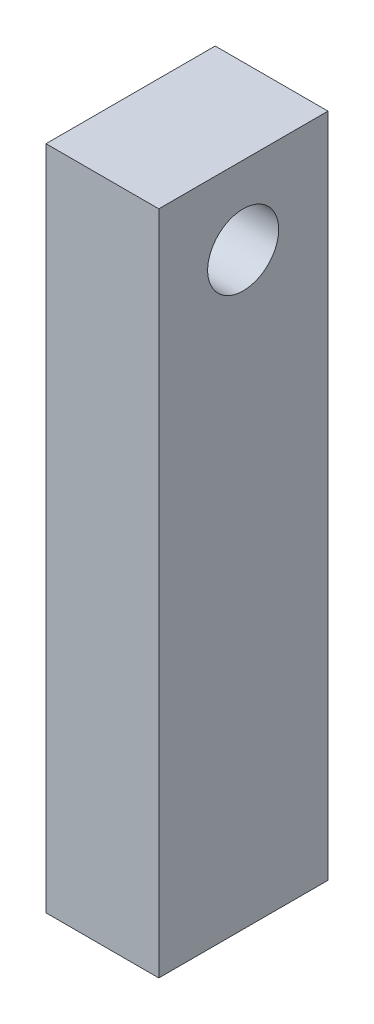
ISO-10303-21;
HEADER;
FILE_DESCRIPTION(('STEP AP214'),'2;1');
FILE_NAME('part.step','',(''),(''),'','','');
FILE_SCHEMA(('AUTOMOTIVE_DESIGN { 1 0 10303 214 1 1 1 1 }'));
ENDSEC;
DATA;
#1=APPLICATION_CONTEXT('core data for automotive mechanical design processes');
#2=APPLICATION_PROTOCOL_DEFINITION('international standard','automotive_design',2000,#1);
#3=PRODUCT_CONTEXT('',#1,'mechanical');
#4=PRODUCT('Part','Part','',(#3));
#5=PRODUCT_RELATED_PRODUCT_CATEGORY('part','',(#4));
#6=PRODUCT_DEFINITION_FORMATION('','',#4);
#7=PRODUCT_DEFINITION_CONTEXT('part definition',#1,'design');
#8=PRODUCT_DEFINITION('design','',#6,#7);
#9=PRODUCT_DEFINITION_SHAPE('','',#8);
#10=(LENGTH_UNIT() NAMED_UNIT(*) SI_UNIT(.MILLI.,.METRE.));
#11=(NAMED_UNIT(*) PLANE_ANGLE_UNIT() SI_UNIT($,.RADIAN.));
#12=(NAMED_UNIT(*) SI_UNIT($,.STERADIAN.) SOLID_ANGLE_UNIT());
#13=UNCERTAINTY_MEASURE_WITH_UNIT(LENGTH_MEASURE(1.E-05),#10,'distance_accuracy_value','');
#14=(GEOMETRIC_REPRESENTATION_CONTEXT(3) GLOBAL_UNCERTAINTY_ASSIGNED_CONTEXT((#13)) GLOBAL_UNIT_ASSIGNED_CONTEXT((#10,
#11,#12)) REPRESENTATION_CONTEXT('',''));
#15=CARTESIAN_POINT('',(0.,0.,0.));
#16=DIRECTION('',(0.,0.,1.));
#17=DIRECTION('',(1.,0.,0.));
#18=AXIS2_PLACEMENT_3D('',#15,#16,#17);
#19=CARTESIAN_POINT('',(0.,300.,0.));
#20=DIRECTION('',(1.,0.,0.));
#21=DIRECTION('',(0.,0.,-1.));
#22=AXIS2_PLACEMENT_3D('',#19,#20,#21);
#23=PLANE('',#22);
#24=CARTESIAN_POINT('',(0.,265.,-38.));
#25=DIRECTION('',(1.,0.,0.));
#26=DIRECTION('',(0.,0.,-1.));
#27=AXIS2_PLACEMENT_3D('',#24,#25,#26);
#28=CIRCLE('',#27,16.);
#29=CARTESIAN_POINT('',(0.,265.,-54.));
#30=VERTEX_POINT('',#29);
#31=EDGE_CURVE('E99',#30,#30,#28,.T.);
#32=ORIENTED_EDGE('',*,*,#31,.T.);
#33=EDGE_LOOP('',(#32));
#34=FACE_BOUND('',#33,.T.);
#35=DIRECTION('',(0.,0.,1.));
#36=VECTOR('',#35,1.);
#37=CARTESIAN_POINT('',(0.,0.,0.));
#38=LINE('',#37,#36);
#39=CARTESIAN_POINT('',(0.,0.,-76.2));
#40=VERTEX_POINT('',#39);
#41=CARTESIAN_POINT('',(0.,0.,0.));
#42=VERTEX_POINT('',#41);
#43=EDGE_CURVE('E96',#40,#42,#38,.T.);
#44=ORIENTED_EDGE('',*,*,#43,.T.);
#45=DIRECTION('',(0.,-1.,0.));
#46=VECTOR('',#45,1.);
#47=CARTESIAN_POINT('',(0.,300.,0.));
#48=LINE('',#47,#46);
#49=CARTESIAN_POINT('',(0.,300.,0.));
#50=VERTEX_POINT('',#49);
#51=EDGE_CURVE('E11',#50,#42,#48,.T.);
#52=ORIENTED_EDGE('',*,*,#51,.F.);
#53=DIRECTION('',(0.,0.,1.));
#54=VECTOR('',#53,1.);
#55=CARTESIAN_POINT('',(0.,300.,0.));
#56=LINE('',#55,#54);
#57=CARTESIAN_POINT('',(0.,300.,-76.2));
#58=VERTEX_POINT('',#57);
#59=EDGE_CURVE('E84',#58,#50,#56,.T.);
#60=ORIENTED_EDGE('',*,*,#59,.F.);
#61=DIRECTION('',(0.,-1.,0.));
#62=VECTOR('',#61,1.);
#63=CARTESIAN_POINT('',(0.,300.,-76.2));
#64=LINE('',#63,#62);
#65=EDGE_CURVE('E92',#58,#40,#64,.T.);
#66=ORIENTED_EDGE('',*,*,#65,.T.);
#67=EDGE_LOOP('',(#44,#52,#60,#66));
#68=FACE_BOUND('',#67,.T.);
#69=ADVANCED_FACE('F33',(#34,#68),#23,.F.);
#70=CARTESIAN_POINT('',(0.,300.,0.));
#71=DIRECTION('',(0.,0.,-1.));
#72=DIRECTION('',(-1.,0.,0.));
#73=AXIS2_PLACEMENT_3D('',#70,#71,#72);
#74=PLANE('',#73);
#75=DIRECTION('',(1.,0.,0.));
#76=VECTOR('',#75,1.);
#77=CARTESIAN_POINT('',(0.,0.,0.));
#78=LINE('',#77,#76);
#79=CARTESIAN_POINT('',(50.8,0.,0.));
#80=VERTEX_POINT('',#79);
#81=EDGE_CURVE('E88',#42,#80,#78,.T.);
#82=ORIENTED_EDGE('',*,*,#81,.T.);
#83=DIRECTION('',(0.,-1.,0.));
#84=VECTOR('',#83,1.);
#85=CARTESIAN_POINT('',(50.8,300.,0.));
#86=LINE('',#85,#84);
#87=CARTESIAN_POINT('',(50.8,300.,0.));
#88=VERTEX_POINT('',#87);
#89=EDGE_CURVE('E41',#88,#80,#86,.T.);
#90=ORIENTED_EDGE('',*,*,#89,.F.);
#91=DIRECTION('',(1.,0.,0.));
#92=VECTOR('',#91,1.);
#93=CARTESIAN_POINT('',(0.,300.,0.));
#94=LINE('',#93,#92);
#95=EDGE_CURVE('E79',#50,#88,#94,.T.);
#96=ORIENTED_EDGE('',*,*,#95,.F.);
#97=ORIENTED_EDGE('',*,*,#51,.T.);
#98=EDGE_LOOP('',(#82,#90,#96,#97));
#99=FACE_BOUND('',#98,.T.);
#100=ADVANCED_FACE('F87',(#99),#74,.F.);
#101=CARTESIAN_POINT('',(50.8,300.,0.));
#102=DIRECTION('',(-1.,0.,0.));
#103=DIRECTION('',(0.,0.,1.));
#104=AXIS2_PLACEMENT_3D('',#101,#102,#103);
#105=PLANE('',#104);
#106=CARTESIAN_POINT('',(50.8,265.,-38.));
#107=DIRECTION('',(1.,0.,0.));
#108=DIRECTION('',(0.,0.,-1.));
#109=AXIS2_PLACEMENT_3D('',#106,#107,#108);
#110=CIRCLE('',#109,16.);
#111=CARTESIAN_POINT('',(50.8,265.,-54.));
#112=VERTEX_POINT('',#111);
#113=EDGE_CURVE('E112',#112,#112,#110,.T.);
#114=ORIENTED_EDGE('',*,*,#113,.F.);
#115=EDGE_LOOP('',(#114));
#116=FACE_BOUND('',#115,.T.);
#117=DIRECTION('',(0.,0.,-1.));
#118=VECTOR('',#117,1.);
#119=CARTESIAN_POINT('',(50.8,0.,0.));
#120=LINE('',#119,#118);
#121=CARTESIAN_POINT('',(50.8,0.,-76.2));
#122=VERTEX_POINT('',#121);
#123=EDGE_CURVE('E66',#80,#122,#120,.T.);
#124=ORIENTED_EDGE('',*,*,#123,.T.);
#125=DIRECTION('',(0.,-1.,0.));
#126=VECTOR('',#125,1.);
#127=CARTESIAN_POINT('',(50.8,300.,-76.2));
#128=LINE('',#127,#126);
#129=CARTESIAN_POINT('',(50.8,300.,-76.2));
#130=VERTEX_POINT('',#129);
#131=EDGE_CURVE('E89',#130,#122,#128,.T.);
#132=ORIENTED_EDGE('',*,*,#131,.F.);
#133=DIRECTION('',(0.,0.,-1.));
#134=VECTOR('',#133,1.);
#135=CARTESIAN_POINT('',(50.8,300.,0.));
#136=LINE('',#135,#134);
#137=EDGE_CURVE('E82',#88,#130,#136,.T.);
#138=ORIENTED_EDGE('',*,*,#137,.F.);
#139=ORIENTED_EDGE('',*,*,#89,.T.);
#140=EDGE_LOOP('',(#124,#132,#138,#139));
#141=FACE_BOUND('',#140,.T.);
#142=ADVANCED_FACE('F90',(#116,#141),#105,.F.);
#143=CARTESIAN_POINT('',(0.,300.,-76.2));
#144=DIRECTION('',(0.,0.,1.));
#145=DIRECTION('',(1.,0.,0.));
#146=AXIS2_PLACEMENT_3D('',#143,#144,#145);
#147=PLANE('',#146);
#148=DIRECTION('',(-1.,0.,0.));
#149=VECTOR('',#148,1.);
#150=CARTESIAN_POINT('',(0.,0.,-76.2));
#151=LINE('',#150,#149);
#152=EDGE_CURVE('E72',#122,#40,#151,.T.);
#153=ORIENTED_EDGE('',*,*,#152,.T.);
#154=ORIENTED_EDGE('',*,*,#65,.F.);
#155=DIRECTION('',(-1.,0.,0.));
#156=VECTOR('',#155,1.);
#157=CARTESIAN_POINT('',(0.,300.,-76.2));
#158=LINE('',#157,#156);
#159=EDGE_CURVE('E49',#130,#58,#158,.T.);
#160=ORIENTED_EDGE('',*,*,#159,.F.);
#161=ORIENTED_EDGE('',*,*,#131,.T.);
#162=EDGE_LOOP('',(#153,#154,#160,#161));
#163=FACE_BOUND('',#162,.T.);
#164=ADVANCED_FACE('F104',(#163),#147,.F.);
#165=CARTESIAN_POINT('',(0.,300.,-76.2));
#166=DIRECTION('',(0.,-1.,0.));
#167=DIRECTION('',(0.,0.,-1.));
#168=AXIS2_PLACEMENT_3D('',#165,#166,#167);
#169=PLANE('',#168);
#170=ORIENTED_EDGE('',*,*,#59,.T.);
#171=ORIENTED_EDGE('',*,*,#95,.T.);
#172=ORIENTED_EDGE('',*,*,#137,.T.);
#173=ORIENTED_EDGE('',*,*,#159,.T.);
#174=EDGE_LOOP('',(#170,#171,#172,#173));
#175=FACE_BOUND('',#174,.T.);
#176=ADVANCED_FACE('F80',(#175),#169,.F.);
#177=CARTESIAN_POINT('',(0.,0.,-76.2));
#178=DIRECTION('',(0.,-1.,0.));
#179=DIRECTION('',(0.,0.,-1.));
#180=AXIS2_PLACEMENT_3D('',#177,#178,#179);
#181=PLANE('',#180);
#182=ORIENTED_EDGE('',*,*,#43,.F.);
#183=ORIENTED_EDGE('',*,*,#152,.F.);
#184=ORIENTED_EDGE('',*,*,#123,.F.);
#185=ORIENTED_EDGE('',*,*,#81,.F.);
#186=EDGE_LOOP('',(#182,#183,#184,#185));
#187=FACE_BOUND('',#186,.T.);
#188=ADVANCED_FACE('F107',(#187),#181,.T.);
#189=CARTESIAN_POINT('',(-99.2,265.,-38.));
#190=DIRECTION('',(1.,0.,0.));
#191=DIRECTION('',(0.,0.,-1.));
#192=AXIS2_PLACEMENT_3D('',#189,#190,#191);
#193=CYLINDRICAL_SURFACE('',#192,16.);
#194=ORIENTED_EDGE('',*,*,#113,.T.);
#195=EDGE_LOOP('',(#194));
#196=FACE_BOUND('',#195,.T.);
#197=ORIENTED_EDGE('',*,*,#31,.F.);
#198=EDGE_LOOP('',(#197));
#199=FACE_BOUND('',#198,.T.);
#200=ADVANCED_FACE('F116',(#196,#199),#193,.F.);
#201=CLOSED_SHELL('',(#69,#100,#142,#164,#176,#188,#200));
#202=MANIFOLD_SOLID_BREP('B2',#201);
#203=ADVANCED_BREP_SHAPE_REPRESENTATION('',(#18,#202),#14);
#204=SHAPE_DEFINITION_REPRESENTATION(#9,#203);
ENDSEC;
END-ISO-10303-21;
